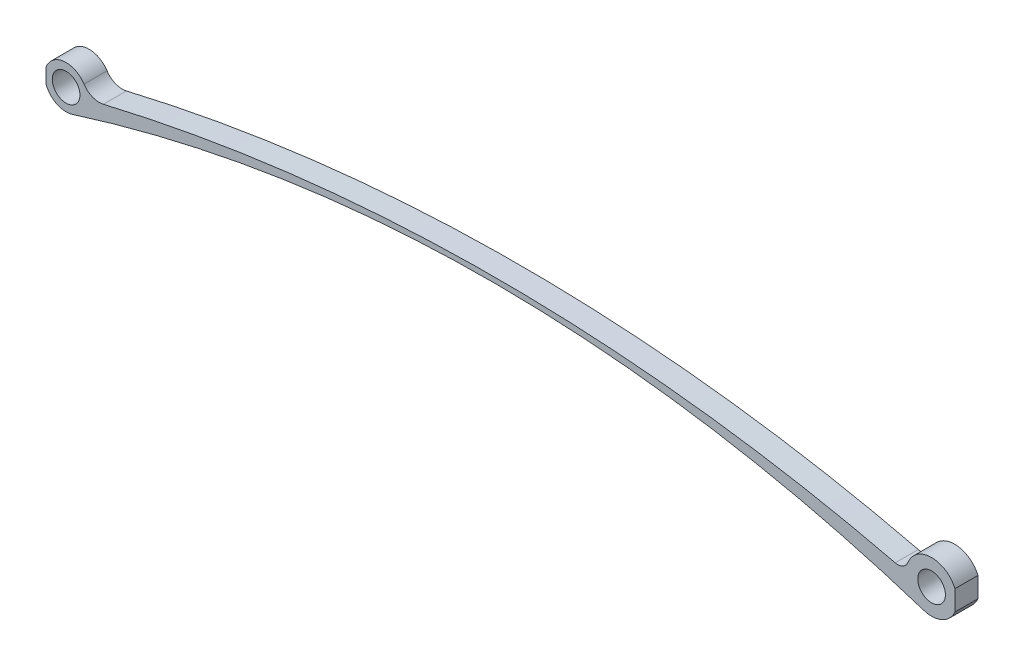
ISO-10303-21;
HEADER;
FILE_DESCRIPTION(('STEP AP214'),'2;1');
FILE_NAME('part.step','',(''),(''),'','','');
FILE_SCHEMA(('AUTOMOTIVE_DESIGN { 1 0 10303 214 1 1 1 1 }'));
ENDSEC;
DATA;
#1=APPLICATION_CONTEXT('core data for automotive mechanical design processes');
#2=APPLICATION_PROTOCOL_DEFINITION('international standard','automotive_design',2000,#1);
#3=PRODUCT_CONTEXT('',#1,'mechanical');
#4=PRODUCT('Part','Part','',(#3));
#5=PRODUCT_RELATED_PRODUCT_CATEGORY('part','',(#4));
#6=PRODUCT_DEFINITION_FORMATION('','',#4);
#7=PRODUCT_DEFINITION_CONTEXT('part definition',#1,'design');
#8=PRODUCT_DEFINITION('design','',#6,#7);
#9=PRODUCT_DEFINITION_SHAPE('','',#8);
#10=(LENGTH_UNIT() NAMED_UNIT(*) SI_UNIT(.MILLI.,.METRE.));
#11=(NAMED_UNIT(*) PLANE_ANGLE_UNIT() SI_UNIT($,.RADIAN.));
#12=(NAMED_UNIT(*) SI_UNIT($,.STERADIAN.) SOLID_ANGLE_UNIT());
#13=UNCERTAINTY_MEASURE_WITH_UNIT(LENGTH_MEASURE(1.E-05),#10,'distance_accuracy_value','');
#14=(GEOMETRIC_REPRESENTATION_CONTEXT(3) GLOBAL_UNCERTAINTY_ASSIGNED_CONTEXT((#13)) GLOBAL_UNIT_ASSIGNED_CONTEXT((#10,
#11,#12)) REPRESENTATION_CONTEXT('',''));
#15=CARTESIAN_POINT('',(0.,0.,0.));
#16=DIRECTION('',(0.,0.,1.));
#17=DIRECTION('',(1.,0.,0.));
#18=AXIS2_PLACEMENT_3D('',#15,#16,#17);
#19=CARTESIAN_POINT('',(46.2165328493387,-145.804867871827,5.));
#20=DIRECTION('',(0.,0.,1.));
#21=DIRECTION('',(1.,0.,0.));
#22=AXIS2_PLACEMENT_3D('',#19,#20,#21);
#23=PLANE('',#22);
#24=CARTESIAN_POINT('',(0.,0.,5.));
#25=DIRECTION('',(0.,0.,1.));
#26=DIRECTION('',(1.,0.,0.));
#27=AXIS2_PLACEMENT_3D('',#24,#25,#26);
#28=CIRCLE('',#27,3.00000007924961);
#29=CARTESIAN_POINT('',(3.00000007924961,0.,5.));
#30=VERTEX_POINT('',#29);
#31=EDGE_CURVE('E176',#30,#30,#28,.T.);
#32=ORIENTED_EDGE('',*,*,#31,.F.);
#33=EDGE_LOOP('',(#32));
#34=FACE_BOUND('',#33,.T.);
#35=CARTESIAN_POINT('',(187.762,0.,5.));
#36=DIRECTION('',(0.,0.,1.));
#37=DIRECTION('',(1.,0.,0.));
#38=AXIS2_PLACEMENT_3D('',#35,#36,#37);
#39=CIRCLE('',#38,3.00000007924962);
#40=CARTESIAN_POINT('',(190.76200007925,0.,5.));
#41=VERTEX_POINT('',#40);
#42=EDGE_CURVE('E206',#41,#41,#39,.T.);
#43=ORIENTED_EDGE('',*,*,#42,.F.);
#44=EDGE_LOOP('',(#43));
#45=FACE_BOUND('',#44,.T.);
#46=CARTESIAN_POINT('',(0.,0.,5.));
#47=DIRECTION('',(0.,0.,1.));
#48=DIRECTION('',(1.,0.,0.));
#49=AXIS2_PLACEMENT_3D('',#46,#47,#48);
#50=CIRCLE('',#49,4.63518821296483);
#51=CARTESIAN_POINT('',(3.8882468393834,2.52319366788066,5.));
#52=VERTEX_POINT('',#51);
#53=CARTESIAN_POINT('',(-4.35681947691644,1.58211687784741,5.));
#54=VERTEX_POINT('',#53);
#55=EDGE_CURVE('E141',#52,#54,#50,.T.);
#56=ORIENTED_EDGE('',*,*,#55,.T.);
#57=DIRECTION('',(0.,1.,0.));
#58=VECTOR('',#57,1.);
#59=CARTESIAN_POINT('',(-4.35681947691644,0.,5.));
#60=LINE('',#59,#58);
#61=CARTESIAN_POINT('',(-4.35681947691644,-1.58211687784741,5.));
#62=VERTEX_POINT('',#61);
#63=EDGE_CURVE('E111',#62,#54,#60,.T.);
#64=ORIENTED_EDGE('',*,*,#63,.F.);
#65=CARTESIAN_POINT('',(1.40056399030959,-4.41852806697617,5.));
#66=VERTEX_POINT('',#65);
#67=EDGE_CURVE('E161',#62,#66,#50,.T.);
#68=ORIENTED_EDGE('',*,*,#67,.T.);
#69=CARTESIAN_POINT('',(92.4330656986774,-291.609735743654,5.));
#70=DIRECTION('',(0.,0.,-1.));
#71=DIRECTION('',(1.,0.,0.));
#72=AXIS2_PLACEMENT_3D('',#69,#70,#71);
#73=CIRCLE('',#72,301.273473996754);
#74=CARTESIAN_POINT('',(186.045988776045,-5.24925179556547,5.));
#75=VERTEX_POINT('',#74);
#76=EDGE_CURVE('E129',#66,#75,#73,.T.);
#77=ORIENTED_EDGE('',*,*,#76,.T.);
#78=CARTESIAN_POINT('',(187.762,0.,5.));
#79=DIRECTION('',(0.,0.,1.));
#80=DIRECTION('',(1.,0.,0.));
#81=AXIS2_PLACEMENT_3D('',#78,#79,#80);
#82=CIRCLE('',#81,5.52262065816453);
#83=CARTESIAN_POINT('',(192.829341952088,-2.19576512282057,5.));
#84=VERTEX_POINT('',#83);
#85=EDGE_CURVE('E198',#75,#84,#82,.T.);
#86=ORIENTED_EDGE('',*,*,#85,.T.);
#87=DIRECTION('',(0.,-1.,0.));
#88=VECTOR('',#87,1.);
#89=CARTESIAN_POINT('',(192.829341952088,0.,5.));
#90=LINE('',#89,#88);
#91=CARTESIAN_POINT('',(192.829341952088,2.19576512282057,5.));
#92=VERTEX_POINT('',#91);
#93=EDGE_CURVE('E212',#92,#84,#90,.T.);
#94=ORIENTED_EDGE('',*,*,#93,.F.);
#95=CARTESIAN_POINT('',(182.617163035091,2.00748388249768,5.));
#96=VERTEX_POINT('',#95);
#97=EDGE_CURVE('E132',#92,#96,#82,.T.);
#98=ORIENTED_EDGE('',*,*,#97,.T.);
#99=CARTESIAN_POINT('',(180.426402418561,2.86230526130721,5.));
#100=DIRECTION('',(0.,0.,-1.));
#101=DIRECTION('',(1.,0.,0.));
#102=AXIS2_PLACEMENT_3D('',#99,#100,#101);
#103=CIRCLE('',#102,2.35162745106605);
#104=CARTESIAN_POINT('',(179.877075260746,0.575737671601129,5.));
#105=VERTEX_POINT('',#104);
#106=EDGE_CURVE('E197',#96,#105,#103,.T.);
#107=ORIENTED_EDGE('',*,*,#106,.T.);
#108=CARTESIAN_POINT('',(93.4372837774002,-359.22883935483,5.));
#109=DIRECTION('',(0.,0.,1.));
#110=DIRECTION('',(1.,0.,0.));
#111=AXIS2_PLACEMENT_3D('',#108,#109,#110);
#112=CIRCLE('',#111,370.042120846875);
#113=CARTESIAN_POINT('',(8.09398686892043,0.837394654476138,5.));
#114=VERTEX_POINT('',#113);
#115=EDGE_CURVE('E168',#105,#114,#112,.T.);
#116=ORIENTED_EDGE('',*,*,#115,.T.);
#117=CARTESIAN_POINT('',(7.18703174415271,4.6638687657441,5.));
#118=DIRECTION('',(0.,0.,-1.));
#119=DIRECTION('',(1.,0.,0.));
#120=AXIS2_PLACEMENT_3D('',#117,#118,#119);
#121=CIRCLE('',#120,3.93248925269305);
#122=EDGE_CURVE('E166',#114,#52,#121,.T.);
#123=ORIENTED_EDGE('',*,*,#122,.T.);
#124=EDGE_LOOP('',(#56,#64,#68,#77,#86,#94,#98,#107,#116,#123));
#125=FACE_BOUND('',#124,.T.);
#126=ADVANCED_FACE('F35',(#34,#45,#125),#23,.T.);
#127=CARTESIAN_POINT('',(46.2165328493387,-145.804867871827,0.));
#128=DIRECTION('',(0.,0.,1.));
#129=DIRECTION('',(1.,0.,0.));
#130=AXIS2_PLACEMENT_3D('',#127,#128,#129);
#131=PLANE('',#130);
#132=CARTESIAN_POINT('',(0.,0.,0.));
#133=DIRECTION('',(0.,0.,1.));
#134=DIRECTION('',(1.,0.,0.));
#135=AXIS2_PLACEMENT_3D('',#132,#133,#134);
#136=CIRCLE('',#135,3.00000007924961);
#137=CARTESIAN_POINT('',(3.00000007924961,0.,0.));
#138=VERTEX_POINT('',#137);
#139=EDGE_CURVE('E203',#138,#138,#136,.T.);
#140=ORIENTED_EDGE('',*,*,#139,.T.);
#141=EDGE_LOOP('',(#140));
#142=FACE_BOUND('',#141,.T.);
#143=CARTESIAN_POINT('',(187.762,0.,0.));
#144=DIRECTION('',(0.,0.,1.));
#145=DIRECTION('',(1.,0.,0.));
#146=AXIS2_PLACEMENT_3D('',#143,#144,#145);
#147=CIRCLE('',#146,3.00000007924962);
#148=CARTESIAN_POINT('',(190.76200007925,0.,0.));
#149=VERTEX_POINT('',#148);
#150=EDGE_CURVE('E209',#149,#149,#147,.T.);
#151=ORIENTED_EDGE('',*,*,#150,.T.);
#152=EDGE_LOOP('',(#151));
#153=FACE_BOUND('',#152,.T.);
#154=DIRECTION('',(0.,1.,0.));
#155=VECTOR('',#154,1.);
#156=CARTESIAN_POINT('',(-4.35681947691644,0.,0.));
#157=LINE('',#156,#155);
#158=CARTESIAN_POINT('',(-4.35681947691644,-1.58211687784741,0.));
#159=VERTEX_POINT('',#158);
#160=CARTESIAN_POINT('',(-4.35681947691644,1.58211687784741,0.));
#161=VERTEX_POINT('',#160);
#162=EDGE_CURVE('E49',#159,#161,#157,.T.);
#163=ORIENTED_EDGE('',*,*,#162,.T.);
#164=CARTESIAN_POINT('',(0.,0.,0.));
#165=DIRECTION('',(0.,0.,1.));
#166=DIRECTION('',(1.,0.,0.));
#167=AXIS2_PLACEMENT_3D('',#164,#165,#166);
#168=CIRCLE('',#167,4.63518821296483);
#169=CARTESIAN_POINT('',(3.8882468393834,2.52319366788066,0.));
#170=VERTEX_POINT('',#169);
#171=EDGE_CURVE('E121',#170,#161,#168,.T.);
#172=ORIENTED_EDGE('',*,*,#171,.F.);
#173=CARTESIAN_POINT('',(7.18703174415271,4.6638687657441,0.));
#174=DIRECTION('',(0.,0.,-1.));
#175=DIRECTION('',(1.,0.,0.));
#176=AXIS2_PLACEMENT_3D('',#173,#174,#175);
#177=CIRCLE('',#176,3.93248925269305);
#178=CARTESIAN_POINT('',(8.09398686892043,0.837394654476138,0.));
#179=VERTEX_POINT('',#178);
#180=EDGE_CURVE('E134',#179,#170,#177,.T.);
#181=ORIENTED_EDGE('',*,*,#180,.F.);
#182=CARTESIAN_POINT('',(93.4372837774002,-359.22883935483,0.));
#183=DIRECTION('',(0.,0.,1.));
#184=DIRECTION('',(1.,0.,0.));
#185=AXIS2_PLACEMENT_3D('',#182,#183,#184);
#186=CIRCLE('',#185,370.042120846875);
#187=CARTESIAN_POINT('',(179.877075260746,0.575737671601129,0.));
#188=VERTEX_POINT('',#187);
#189=EDGE_CURVE('E181',#188,#179,#186,.T.);
#190=ORIENTED_EDGE('',*,*,#189,.F.);
#191=CARTESIAN_POINT('',(180.426402418561,2.86230526130721,0.));
#192=DIRECTION('',(0.,0.,-1.));
#193=DIRECTION('',(1.,0.,0.));
#194=AXIS2_PLACEMENT_3D('',#191,#192,#193);
#195=CIRCLE('',#194,2.35162745106605);
#196=CARTESIAN_POINT('',(182.617163035091,2.00748388249768,0.));
#197=VERTEX_POINT('',#196);
#198=EDGE_CURVE('E180',#197,#188,#195,.T.);
#199=ORIENTED_EDGE('',*,*,#198,.F.);
#200=CARTESIAN_POINT('',(187.762,0.,0.));
#201=DIRECTION('',(0.,0.,1.));
#202=DIRECTION('',(1.,0.,0.));
#203=AXIS2_PLACEMENT_3D('',#200,#201,#202);
#204=CIRCLE('',#203,5.52262065816453);
#205=CARTESIAN_POINT('',(192.829341952088,2.19576512282057,0.));
#206=VERTEX_POINT('',#205);
#207=EDGE_CURVE('E175',#206,#197,#204,.T.);
#208=ORIENTED_EDGE('',*,*,#207,.F.);
#209=DIRECTION('',(0.,-1.,0.));
#210=VECTOR('',#209,1.);
#211=CARTESIAN_POINT('',(192.829341952088,0.,0.));
#212=LINE('',#211,#210);
#213=CARTESIAN_POINT('',(192.829341952088,-2.19576512282057,0.));
#214=VERTEX_POINT('',#213);
#215=EDGE_CURVE('E57',#206,#214,#212,.T.);
#216=ORIENTED_EDGE('',*,*,#215,.T.);
#217=CARTESIAN_POINT('',(186.045988776045,-5.24925179556547,0.));
#218=VERTEX_POINT('',#217);
#219=EDGE_CURVE('E177',#218,#214,#204,.T.);
#220=ORIENTED_EDGE('',*,*,#219,.F.);
#221=CARTESIAN_POINT('',(92.4330656986774,-291.609735743654,0.));
#222=DIRECTION('',(0.,0.,-1.));
#223=DIRECTION('',(1.,0.,0.));
#224=AXIS2_PLACEMENT_3D('',#221,#222,#223);
#225=CIRCLE('',#224,301.273473996754);
#226=CARTESIAN_POINT('',(1.40056399030959,-4.41852806697617,0.));
#227=VERTEX_POINT('',#226);
#228=EDGE_CURVE('E172',#227,#218,#225,.T.);
#229=ORIENTED_EDGE('',*,*,#228,.F.);
#230=EDGE_CURVE('E123',#159,#227,#168,.T.);
#231=ORIENTED_EDGE('',*,*,#230,.F.);
#232=EDGE_LOOP('',(#163,#172,#181,#190,#199,#208,#216,#220,#229,#231));
#233=FACE_BOUND('',#232,.T.);
#234=ADVANCED_FACE('F119',(#142,#153,#233),#131,.F.);
#235=CARTESIAN_POINT('',(0.,0.,5.));
#236=DIRECTION('',(0.,0.,-1.));
#237=DIRECTION('',(-1.,0.,0.));
#238=AXIS2_PLACEMENT_3D('',#235,#236,#237);
#239=CYLINDRICAL_SURFACE('',#238,4.63518821296483);
#240=DIRECTION('',(0.,0.,-1.));
#241=VECTOR('',#240,1.);
#242=CARTESIAN_POINT('',(-4.35681947691644,1.58211687784741,5.));
#243=LINE('',#242,#241);
#244=EDGE_CURVE('E11',#54,#161,#243,.T.);
#245=ORIENTED_EDGE('',*,*,#244,.F.);
#246=ORIENTED_EDGE('',*,*,#55,.F.);
#247=DIRECTION('',(0.,0.,-1.));
#248=VECTOR('',#247,1.);
#249=CARTESIAN_POINT('',(3.8882468393834,2.52319366788066,5.));
#250=LINE('',#249,#248);
#251=EDGE_CURVE('E128',#52,#170,#250,.T.);
#252=ORIENTED_EDGE('',*,*,#251,.T.);
#253=ORIENTED_EDGE('',*,*,#171,.T.);
#254=EDGE_LOOP('',(#245,#246,#252,#253));
#255=FACE_BOUND('',#254,.T.);
#256=ADVANCED_FACE('F126',(#255),#239,.T.);
#257=DIRECTION('',(0.,0.,-1.));
#258=VECTOR('',#257,1.);
#259=CARTESIAN_POINT('',(-4.35681947691644,-1.58211687784741,5.));
#260=LINE('',#259,#258);
#261=EDGE_CURVE('E43',#159,#62,#260,.F.);
#262=ORIENTED_EDGE('',*,*,#261,.F.);
#263=ORIENTED_EDGE('',*,*,#230,.T.);
#264=DIRECTION('',(0.,0.,-1.));
#265=VECTOR('',#264,1.);
#266=CARTESIAN_POINT('',(1.40056399030959,-4.41852806697617,5.));
#267=LINE('',#266,#265);
#268=EDGE_CURVE('E138',#66,#227,#267,.T.);
#269=ORIENTED_EDGE('',*,*,#268,.F.);
#270=ORIENTED_EDGE('',*,*,#67,.F.);
#271=EDGE_LOOP('',(#262,#263,#269,#270));
#272=FACE_BOUND('',#271,.T.);
#273=ADVANCED_FACE('F164',(#272),#239,.T.);
#274=CARTESIAN_POINT('',(187.762,0.,5.));
#275=DIRECTION('',(0.,0.,-1.));
#276=DIRECTION('',(-1.,0.,0.));
#277=AXIS2_PLACEMENT_3D('',#274,#275,#276);
#278=CYLINDRICAL_SURFACE('',#277,5.52262065816453);
#279=DIRECTION('',(0.,0.,-1.));
#280=VECTOR('',#279,1.);
#281=CARTESIAN_POINT('',(192.829341952088,-2.19576512282057,5.));
#282=LINE('',#281,#280);
#283=EDGE_CURVE('E157',#84,#214,#282,.T.);
#284=ORIENTED_EDGE('',*,*,#283,.F.);
#285=ORIENTED_EDGE('',*,*,#85,.F.);
#286=DIRECTION('',(0.,0.,-1.));
#287=VECTOR('',#286,1.);
#288=CARTESIAN_POINT('',(186.045988776045,-5.24925179556547,5.));
#289=LINE('',#288,#287);
#290=EDGE_CURVE('E152',#75,#218,#289,.T.);
#291=ORIENTED_EDGE('',*,*,#290,.T.);
#292=ORIENTED_EDGE('',*,*,#219,.T.);
#293=EDGE_LOOP('',(#284,#285,#291,#292));
#294=FACE_BOUND('',#293,.T.);
#295=ADVANCED_FACE('F221',(#294),#278,.T.);
#296=DIRECTION('',(0.,0.,-1.));
#297=VECTOR('',#296,1.);
#298=CARTESIAN_POINT('',(192.829341952088,2.19576512282057,5.));
#299=LINE('',#298,#297);
#300=EDGE_CURVE('E155',#206,#92,#299,.F.);
#301=ORIENTED_EDGE('',*,*,#300,.F.);
#302=ORIENTED_EDGE('',*,*,#207,.T.);
#303=DIRECTION('',(0.,0.,-1.));
#304=VECTOR('',#303,1.);
#305=CARTESIAN_POINT('',(182.617163035091,2.00748388249768,5.));
#306=LINE('',#305,#304);
#307=EDGE_CURVE('E149',#96,#197,#306,.T.);
#308=ORIENTED_EDGE('',*,*,#307,.F.);
#309=ORIENTED_EDGE('',*,*,#97,.F.);
#310=EDGE_LOOP('',(#301,#302,#308,#309));
#311=FACE_BOUND('',#310,.T.);
#312=ADVANCED_FACE('F225',(#311),#278,.T.);
#313=CARTESIAN_POINT('',(92.4330656986774,-291.609735743654,5.));
#314=DIRECTION('',(0.,0.,-1.));
#315=DIRECTION('',(-1.,0.,0.));
#316=AXIS2_PLACEMENT_3D('',#313,#314,#315);
#317=CYLINDRICAL_SURFACE('',#316,301.273473996754);
#318=ORIENTED_EDGE('',*,*,#228,.T.);
#319=ORIENTED_EDGE('',*,*,#290,.F.);
#320=ORIENTED_EDGE('',*,*,#76,.F.);
#321=ORIENTED_EDGE('',*,*,#268,.T.);
#322=EDGE_LOOP('',(#318,#319,#320,#321));
#323=FACE_BOUND('',#322,.T.);
#324=ADVANCED_FACE('F37',(#323),#317,.F.);
#325=CARTESIAN_POINT('',(180.426402418561,2.86230526130721,5.));
#326=DIRECTION('',(0.,0.,-1.));
#327=DIRECTION('',(-1.,0.,0.));
#328=AXIS2_PLACEMENT_3D('',#325,#326,#327);
#329=CYLINDRICAL_SURFACE('',#328,2.35162745106605);
#330=ORIENTED_EDGE('',*,*,#198,.T.);
#331=DIRECTION('',(0.,0.,-1.));
#332=VECTOR('',#331,1.);
#333=CARTESIAN_POINT('',(179.877075260746,0.575737671601129,5.));
#334=LINE('',#333,#332);
#335=EDGE_CURVE('E146',#105,#188,#334,.T.);
#336=ORIENTED_EDGE('',*,*,#335,.F.);
#337=ORIENTED_EDGE('',*,*,#106,.F.);
#338=ORIENTED_EDGE('',*,*,#307,.T.);
#339=EDGE_LOOP('',(#330,#336,#337,#338));
#340=FACE_BOUND('',#339,.T.);
#341=ADVANCED_FACE('F192',(#340),#329,.F.);
#342=CARTESIAN_POINT('',(93.4372837774002,-359.22883935483,5.));
#343=DIRECTION('',(0.,0.,-1.));
#344=DIRECTION('',(-1.,0.,0.));
#345=AXIS2_PLACEMENT_3D('',#342,#343,#344);
#346=CYLINDRICAL_SURFACE('',#345,370.042120846875);
#347=ORIENTED_EDGE('',*,*,#189,.T.);
#348=DIRECTION('',(0.,0.,-1.));
#349=VECTOR('',#348,1.);
#350=CARTESIAN_POINT('',(8.09398686892043,0.837394654476138,5.));
#351=LINE('',#350,#349);
#352=EDGE_CURVE('E143',#114,#179,#351,.T.);
#353=ORIENTED_EDGE('',*,*,#352,.F.);
#354=ORIENTED_EDGE('',*,*,#115,.F.);
#355=ORIENTED_EDGE('',*,*,#335,.T.);
#356=EDGE_LOOP('',(#347,#353,#354,#355));
#357=FACE_BOUND('',#356,.T.);
#358=ADVANCED_FACE('F196',(#357),#346,.T.);
#359=CARTESIAN_POINT('',(7.18703174415271,4.6638687657441,5.));
#360=DIRECTION('',(0.,0.,-1.));
#361=DIRECTION('',(-1.,0.,0.));
#362=AXIS2_PLACEMENT_3D('',#359,#360,#361);
#363=CYLINDRICAL_SURFACE('',#362,3.93248925269305);
#364=ORIENTED_EDGE('',*,*,#180,.T.);
#365=ORIENTED_EDGE('',*,*,#251,.F.);
#366=ORIENTED_EDGE('',*,*,#122,.F.);
#367=ORIENTED_EDGE('',*,*,#352,.T.);
#368=EDGE_LOOP('',(#364,#365,#366,#367));
#369=FACE_BOUND('',#368,.T.);
#370=ADVANCED_FACE('F186',(#369),#363,.F.);
#371=CARTESIAN_POINT('',(0.,0.,5.));
#372=DIRECTION('',(0.,0.,-1.));
#373=DIRECTION('',(-1.,0.,0.));
#374=AXIS2_PLACEMENT_3D('',#371,#372,#373);
#375=CYLINDRICAL_SURFACE('',#374,3.00000007924961);
#376=ORIENTED_EDGE('',*,*,#31,.T.);
#377=EDGE_LOOP('',(#376));
#378=FACE_BOUND('',#377,.T.);
#379=ORIENTED_EDGE('',*,*,#139,.F.);
#380=EDGE_LOOP('',(#379));
#381=FACE_BOUND('',#380,.T.);
#382=ADVANCED_FACE('F243',(#378,#381),#375,.F.);
#383=CARTESIAN_POINT('',(187.762,0.,5.));
#384=DIRECTION('',(0.,0.,-1.));
#385=DIRECTION('',(-1.,0.,0.));
#386=AXIS2_PLACEMENT_3D('',#383,#384,#385);
#387=CYLINDRICAL_SURFACE('',#386,3.00000007924962);
#388=ORIENTED_EDGE('',*,*,#42,.T.);
#389=EDGE_LOOP('',(#388));
#390=FACE_BOUND('',#389,.T.);
#391=ORIENTED_EDGE('',*,*,#150,.F.);
#392=EDGE_LOOP('',(#391));
#393=FACE_BOUND('',#392,.T.);
#394=ADVANCED_FACE('F275',(#390,#393),#387,.F.);
#395=CARTESIAN_POINT('',(192.829341952088,0.,5.));
#396=DIRECTION('',(1.,0.,0.));
#397=DIRECTION('',(0.,0.,-1.));
#398=AXIS2_PLACEMENT_3D('',#395,#396,#397);
#399=PLANE('',#398);
#400=ORIENTED_EDGE('',*,*,#283,.T.);
#401=ORIENTED_EDGE('',*,*,#215,.F.);
#402=ORIENTED_EDGE('',*,*,#300,.T.);
#403=ORIENTED_EDGE('',*,*,#93,.T.);
#404=EDGE_LOOP('',(#400,#401,#402,#403));
#405=FACE_BOUND('',#404,.T.);
#406=ADVANCED_FACE('F218',(#405),#399,.T.);
#407=CARTESIAN_POINT('',(-4.35681947691644,0.,5.));
#408=DIRECTION('',(-1.,0.,0.));
#409=DIRECTION('',(0.,0.,1.));
#410=AXIS2_PLACEMENT_3D('',#407,#408,#409);
#411=PLANE('',#410);
#412=ORIENTED_EDGE('',*,*,#244,.T.);
#413=ORIENTED_EDGE('',*,*,#162,.F.);
#414=ORIENTED_EDGE('',*,*,#261,.T.);
#415=ORIENTED_EDGE('',*,*,#63,.T.);
#416=EDGE_LOOP('',(#412,#413,#414,#415));
#417=FACE_BOUND('',#416,.T.);
#418=ADVANCED_FACE('F109',(#417),#411,.T.);
#419=CLOSED_SHELL('',(#126,#234,#256,#273,#295,#312,#324,#341,#358,#370,#382,#394,#406,#418));
#420=MANIFOLD_SOLID_BREP('B2',#419);
#421=ADVANCED_BREP_SHAPE_REPRESENTATION('',(#18,#420),#14);
#422=SHAPE_DEFINITION_REPRESENTATION(#9,#421);
ENDSEC;
END-ISO-10303-21;
